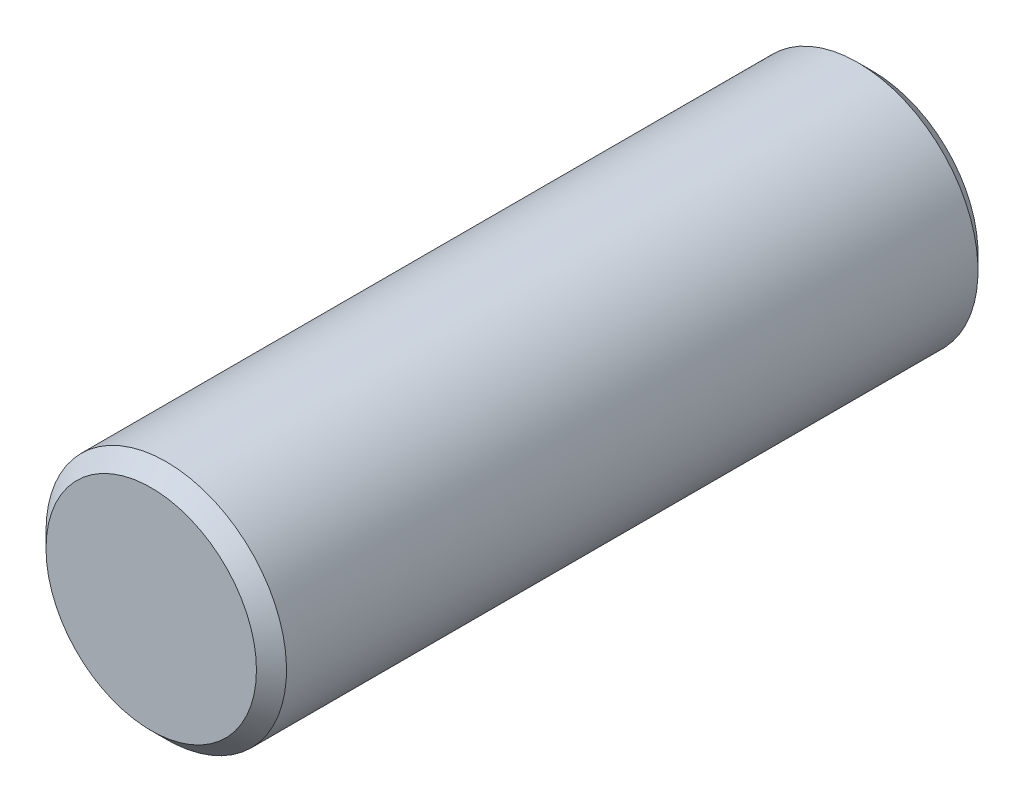
ISO-10303-21;
HEADER;
FILE_DESCRIPTION(('STEP AP214'),'2;1');
FILE_NAME('part.step','',(''),(''),'','','');
FILE_SCHEMA(('AUTOMOTIVE_DESIGN { 1 0 10303 214 1 1 1 1 }'));
ENDSEC;
DATA;
#1=APPLICATION_CONTEXT('core data for automotive mechanical design processes');
#2=APPLICATION_PROTOCOL_DEFINITION('international standard','automotive_design',2000,#1);
#3=PRODUCT_CONTEXT('',#1,'mechanical');
#4=PRODUCT('Part','Part','',(#3));
#5=PRODUCT_RELATED_PRODUCT_CATEGORY('part','',(#4));
#6=PRODUCT_DEFINITION_FORMATION('','',#4);
#7=PRODUCT_DEFINITION_CONTEXT('part definition',#1,'design');
#8=PRODUCT_DEFINITION('design','',#6,#7);
#9=PRODUCT_DEFINITION_SHAPE('','',#8);
#10=(LENGTH_UNIT() NAMED_UNIT(*) SI_UNIT(.MILLI.,.METRE.));
#11=(NAMED_UNIT(*) PLANE_ANGLE_UNIT() SI_UNIT($,.RADIAN.));
#12=(NAMED_UNIT(*) SI_UNIT($,.STERADIAN.) SOLID_ANGLE_UNIT());
#13=UNCERTAINTY_MEASURE_WITH_UNIT(LENGTH_MEASURE(1.E-05),#10,'distance_accuracy_value','');
#14=(GEOMETRIC_REPRESENTATION_CONTEXT(3) GLOBAL_UNCERTAINTY_ASSIGNED_CONTEXT((#13)) GLOBAL_UNIT_ASSIGNED_CONTEXT((#10,
#11,#12)) REPRESENTATION_CONTEXT('',''));
#15=CARTESIAN_POINT('',(0.,0.,0.));
#16=DIRECTION('',(0.,0.,1.));
#17=DIRECTION('',(1.,0.,0.));
#18=AXIS2_PLACEMENT_3D('',#15,#16,#17);
#19=CARTESIAN_POINT('',(0.,0.,5.99999999999999));
#20=DIRECTION('',(0.,0.,1.));
#21=DIRECTION('',(0.,-1.,0.));
#22=AXIS2_PLACEMENT_3D('',#19,#20,#21);
#23=PLANE('',#22);
#24=CARTESIAN_POINT('',(0.,0.,6.00000000002865));
#25=DIRECTION('',(0.,0.,-1.));
#26=DIRECTION('',(-1.,0.,0.));
#27=AXIS2_PLACEMENT_3D('',#24,#25,#26);
#28=CIRCLE('',#27,1.74999999995862);
#29=CARTESIAN_POINT('',(-1.74999999995862,0.,6.00000000002865));
#30=VERTEX_POINT('',#29);
#31=EDGE_CURVE('E17',#30,#30,#28,.T.);
#32=ORIENTED_EDGE('',*,*,#31,.F.);
#33=EDGE_LOOP('',(#32));
#34=FACE_BOUND('',#33,.T.);
#35=ADVANCED_FACE('F14',(#34),#23,.T.);
#36=CARTESIAN_POINT('',(0.,0.,-6.));
#37=DIRECTION('',(0.,0.,1.));
#38=DIRECTION('',(0.,-1.,0.));
#39=AXIS2_PLACEMENT_3D('',#36,#37,#38);
#40=PLANE('',#39);
#41=CARTESIAN_POINT('',(0.,0.,-6.00000000002865));
#42=DIRECTION('',(0.,0.,1.));
#43=DIRECTION('',(0.,-1.,0.));
#44=AXIS2_PLACEMENT_3D('',#41,#42,#43);
#45=CIRCLE('',#44,1.75000000001546);
#46=CARTESIAN_POINT('',(0.,-1.75000000001546,-6.00000000002865));
#47=VERTEX_POINT('',#46);
#48=EDGE_CURVE('E26',#47,#47,#45,.T.);
#49=ORIENTED_EDGE('',*,*,#48,.F.);
#50=EDGE_LOOP('',(#49));
#51=FACE_BOUND('',#50,.T.);
#52=ADVANCED_FACE('F37',(#51),#40,.F.);
#53=CARTESIAN_POINT('',(0.,0.,5.75000000003456));
#54=DIRECTION('',(0.,0.,-1.));
#55=DIRECTION('',(-1.,0.,0.));
#56=AXIS2_PLACEMENT_3D('',#53,#54,#55);
#57=CONICAL_SURFACE('',#56,1.99999999995271,0.785398163397448);
#58=CARTESIAN_POINT('',(0.,0.,5.74999999999999));
#59=DIRECTION('',(0.,0.,-1.));
#60=DIRECTION('',(0.,1.,0.));
#61=AXIS2_PLACEMENT_3D('',#58,#59,#60);
#62=CIRCLE('',#61,2.);
#63=CARTESIAN_POINT('',(0.,2.,5.74999999999999));
#64=VERTEX_POINT('',#63);
#65=EDGE_CURVE('E21',#64,#64,#62,.T.);
#66=ORIENTED_EDGE('',*,*,#65,.F.);
#67=EDGE_LOOP('',(#66));
#68=FACE_BOUND('',#67,.T.);
#69=ORIENTED_EDGE('',*,*,#31,.T.);
#70=EDGE_LOOP('',(#69));
#71=FACE_BOUND('',#70,.T.);
#72=ADVANCED_FACE('F34',(#68,#71),#57,.T.);
#73=CARTESIAN_POINT('',(0.,0.,-5.7500000000914));
#74=DIRECTION('',(0.,0.,1.));
#75=DIRECTION('',(0.,-1.,0.));
#76=AXIS2_PLACEMENT_3D('',#73,#74,#75);
#77=CONICAL_SURFACE('',#76,1.99999999989586,0.785398163283761);
#78=CARTESIAN_POINT('',(0.,0.,-5.75));
#79=DIRECTION('',(0.,0.,-1.));
#80=DIRECTION('',(0.,1.,0.));
#81=AXIS2_PLACEMENT_3D('',#78,#79,#80);
#82=CIRCLE('',#81,2.);
#83=CARTESIAN_POINT('',(0.,2.,-5.75));
#84=VERTEX_POINT('',#83);
#85=EDGE_CURVE('E10',#84,#84,#82,.F.);
#86=ORIENTED_EDGE('',*,*,#85,.F.);
#87=EDGE_LOOP('',(#86));
#88=FACE_BOUND('',#87,.T.);
#89=ORIENTED_EDGE('',*,*,#48,.T.);
#90=EDGE_LOOP('',(#89));
#91=FACE_BOUND('',#90,.T.);
#92=ADVANCED_FACE('F45',(#88,#91),#77,.T.);
#93=CARTESIAN_POINT('',(0.,0.,5.99999999999999));
#94=DIRECTION('',(0.,0.,-1.));
#95=DIRECTION('',(0.,1.,0.));
#96=AXIS2_PLACEMENT_3D('',#93,#94,#95);
#97=CYLINDRICAL_SURFACE('',#96,2.);
#98=ORIENTED_EDGE('',*,*,#85,.T.);
#99=EDGE_LOOP('',(#98));
#100=FACE_BOUND('',#99,.T.);
#101=ORIENTED_EDGE('',*,*,#65,.T.);
#102=EDGE_LOOP('',(#101));
#103=FACE_BOUND('',#102,.T.);
#104=ADVANCED_FACE('F43',(#100,#103),#97,.T.);
#105=CLOSED_SHELL('',(#35,#52,#72,#92,#104));
#106=MANIFOLD_SOLID_BREP('B1',#105);
#107=ADVANCED_BREP_SHAPE_REPRESENTATION('',(#18,#106),#14);
#108=SHAPE_DEFINITION_REPRESENTATION(#9,#107);
ENDSEC;
END-ISO-10303-21;
